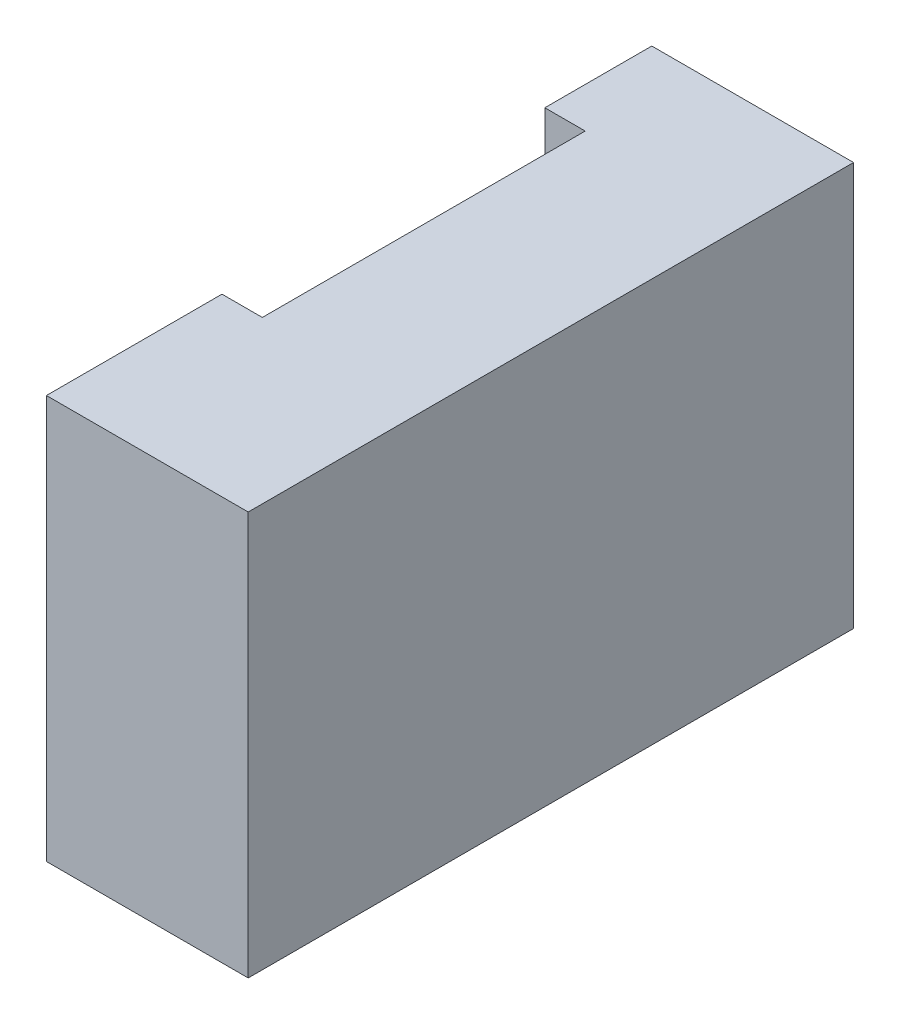
ISO-10303-21;
HEADER;
FILE_DESCRIPTION(('STEP AP214'),'2;1');
FILE_NAME('part.step','',(''),(''),'','','');
FILE_SCHEMA(('AUTOMOTIVE_DESIGN { 1 0 10303 214 1 1 1 1 }'));
ENDSEC;
DATA;
#1=APPLICATION_CONTEXT('core data for automotive mechanical design processes');
#2=APPLICATION_PROTOCOL_DEFINITION('international standard','automotive_design',2000,#1);
#3=PRODUCT_CONTEXT('',#1,'mechanical');
#4=PRODUCT('Part','Part','',(#3));
#5=PRODUCT_RELATED_PRODUCT_CATEGORY('part','',(#4));
#6=PRODUCT_DEFINITION_FORMATION('','',#4);
#7=PRODUCT_DEFINITION_CONTEXT('part definition',#1,'design');
#8=PRODUCT_DEFINITION('design','',#6,#7);
#9=PRODUCT_DEFINITION_SHAPE('','',#8);
#10=(LENGTH_UNIT() NAMED_UNIT(*) SI_UNIT(.MILLI.,.METRE.));
#11=(NAMED_UNIT(*) PLANE_ANGLE_UNIT() SI_UNIT($,.RADIAN.));
#12=(NAMED_UNIT(*) SI_UNIT($,.STERADIAN.) SOLID_ANGLE_UNIT());
#13=UNCERTAINTY_MEASURE_WITH_UNIT(LENGTH_MEASURE(1.E-05),#10,'distance_accuracy_value','');
#14=(GEOMETRIC_REPRESENTATION_CONTEXT(3) GLOBAL_UNCERTAINTY_ASSIGNED_CONTEXT((#13)) GLOBAL_UNIT_ASSIGNED_CONTEXT((#10,
#11,#12)) REPRESENTATION_CONTEXT('',''));
#15=CARTESIAN_POINT('',(0.,0.,0.));
#16=DIRECTION('',(0.,0.,1.));
#17=DIRECTION('',(1.,0.,0.));
#18=AXIS2_PLACEMENT_3D('',#15,#16,#17);
#19=CARTESIAN_POINT('',(-2.5,-5.,7.5));
#20=DIRECTION('',(1.,0.,0.));
#21=DIRECTION('',(0.,0.,-1.));
#22=AXIS2_PLACEMENT_3D('',#19,#20,#21);
#23=PLANE('',#22);
#24=DIRECTION('',(0.,0.,-1.));
#25=VECTOR('',#24,1.);
#26=CARTESIAN_POINT('',(-2.5,-5.,7.5));
#27=LINE('',#26,#25);
#28=CARTESIAN_POINT('',(-2.5,-5.,-4.85));
#29=VERTEX_POINT('',#28);
#30=CARTESIAN_POINT('',(-2.5,-5.,-7.5));
#31=VERTEX_POINT('',#30);
#32=EDGE_CURVE('E125',#29,#31,#27,.T.);
#33=ORIENTED_EDGE('',*,*,#32,.F.);
#34=DIRECTION('',(0.,1.,0.));
#35=VECTOR('',#34,1.);
#36=CARTESIAN_POINT('',(-2.5,-5.,-4.85));
#37=LINE('',#36,#35);
#38=CARTESIAN_POINT('',(-2.5,5.,-4.85));
#39=VERTEX_POINT('',#38);
#40=EDGE_CURVE('E141',#29,#39,#37,.T.);
#41=ORIENTED_EDGE('',*,*,#40,.T.);
#42=DIRECTION('',(0.,0.,-1.));
#43=VECTOR('',#42,1.);
#44=CARTESIAN_POINT('',(-2.5,5.,7.5));
#45=LINE('',#44,#43);
#46=CARTESIAN_POINT('',(-2.5,5.,-7.5));
#47=VERTEX_POINT('',#46);
#48=EDGE_CURVE('E124',#39,#47,#45,.T.);
#49=ORIENTED_EDGE('',*,*,#48,.T.);
#50=DIRECTION('',(0.,-1.,0.));
#51=VECTOR('',#50,1.);
#52=CARTESIAN_POINT('',(-2.5,-5.,-7.5));
#53=LINE('',#52,#51);
#54=EDGE_CURVE('E132',#47,#31,#53,.T.);
#55=ORIENTED_EDGE('',*,*,#54,.T.);
#56=EDGE_LOOP('',(#33,#41,#49,#55));
#57=FACE_BOUND('',#56,.T.);
#58=ADVANCED_FACE('F33',(#57),#23,.F.);
#59=CARTESIAN_POINT('',(2.5,-5.,7.5));
#60=DIRECTION('',(-1.,0.,0.));
#61=DIRECTION('',(0.,0.,1.));
#62=AXIS2_PLACEMENT_3D('',#59,#60,#61);
#63=PLANE('',#62);
#64=DIRECTION('',(0.,1.,0.));
#65=VECTOR('',#64,1.);
#66=CARTESIAN_POINT('',(2.5,-5.,-7.5));
#67=LINE('',#66,#65);
#68=CARTESIAN_POINT('',(2.5,-5.,-7.5));
#69=VERTEX_POINT('',#68);
#70=CARTESIAN_POINT('',(2.5,5.,-7.5));
#71=VERTEX_POINT('',#70);
#72=EDGE_CURVE('E138',#69,#71,#67,.T.);
#73=ORIENTED_EDGE('',*,*,#72,.T.);
#74=DIRECTION('',(0.,0.,-1.));
#75=VECTOR('',#74,1.);
#76=CARTESIAN_POINT('',(2.5,5.,7.5));
#77=LINE('',#76,#75);
#78=CARTESIAN_POINT('',(2.5,5.,7.5));
#79=VERTEX_POINT('',#78);
#80=EDGE_CURVE('E11',#79,#71,#77,.T.);
#81=ORIENTED_EDGE('',*,*,#80,.F.);
#82=DIRECTION('',(0.,1.,0.));
#83=VECTOR('',#82,1.);
#84=CARTESIAN_POINT('',(2.5,-5.,7.5));
#85=LINE('',#84,#83);
#86=CARTESIAN_POINT('',(2.5,-5.,7.5));
#87=VERTEX_POINT('',#86);
#88=EDGE_CURVE('E131',#87,#79,#85,.T.);
#89=ORIENTED_EDGE('',*,*,#88,.F.);
#90=DIRECTION('',(0.,0.,-1.));
#91=VECTOR('',#90,1.);
#92=CARTESIAN_POINT('',(2.5,-5.,7.5));
#93=LINE('',#92,#91);
#94=EDGE_CURVE('E127',#87,#69,#93,.T.);
#95=ORIENTED_EDGE('',*,*,#94,.T.);
#96=EDGE_LOOP('',(#73,#81,#89,#95));
#97=FACE_BOUND('',#96,.T.);
#98=ADVANCED_FACE('F35',(#97),#63,.F.);
#99=CARTESIAN_POINT('',(-2.5,5.,7.5));
#100=DIRECTION('',(0.,-1.,0.));
#101=DIRECTION('',(0.,0.,-1.));
#102=AXIS2_PLACEMENT_3D('',#99,#100,#101);
#103=PLANE('',#102);
#104=ORIENTED_EDGE('',*,*,#48,.F.);
#105=DIRECTION('',(-1.,0.,0.));
#106=VECTOR('',#105,1.);
#107=CARTESIAN_POINT('',(-2.5,5.,-4.85));
#108=LINE('',#107,#106);
#109=CARTESIAN_POINT('',(-1.5,5.,-4.85));
#110=VERTEX_POINT('',#109);
#111=EDGE_CURVE('E113',#110,#39,#108,.T.);
#112=ORIENTED_EDGE('',*,*,#111,.F.);
#113=DIRECTION('',(0.,0.,-1.));
#114=VECTOR('',#113,1.);
#115=CARTESIAN_POINT('',(-1.5,5.,-4.85));
#116=LINE('',#115,#114);
#117=CARTESIAN_POINT('',(-1.5,5.,3.15));
#118=VERTEX_POINT('',#117);
#119=EDGE_CURVE('E153',#118,#110,#116,.T.);
#120=ORIENTED_EDGE('',*,*,#119,.F.);
#121=DIRECTION('',(1.,0.,0.));
#122=VECTOR('',#121,1.);
#123=CARTESIAN_POINT('',(-2.5,5.,3.15));
#124=LINE('',#123,#122);
#125=CARTESIAN_POINT('',(-2.5,5.,3.15));
#126=VERTEX_POINT('',#125);
#127=EDGE_CURVE('E156',#126,#118,#124,.T.);
#128=ORIENTED_EDGE('',*,*,#127,.F.);
#129=CARTESIAN_POINT('',(-2.5,5.,7.5));
#130=VERTEX_POINT('',#129);
#131=EDGE_CURVE('E41',#130,#126,#45,.T.);
#132=ORIENTED_EDGE('',*,*,#131,.F.);
#133=DIRECTION('',(-1.,0.,0.));
#134=VECTOR('',#133,1.);
#135=CARTESIAN_POINT('',(-2.5,5.,7.5));
#136=LINE('',#135,#134);
#137=EDGE_CURVE('E84',#79,#130,#136,.T.);
#138=ORIENTED_EDGE('',*,*,#137,.F.);
#139=ORIENTED_EDGE('',*,*,#80,.T.);
#140=DIRECTION('',(-1.,0.,0.));
#141=VECTOR('',#140,1.);
#142=CARTESIAN_POINT('',(-2.5,5.,-7.5));
#143=LINE('',#142,#141);
#144=EDGE_CURVE('E135',#71,#47,#143,.T.);
#145=ORIENTED_EDGE('',*,*,#144,.T.);
#146=EDGE_LOOP('',(#104,#112,#120,#128,#132,#138,#139,#145));
#147=FACE_BOUND('',#146,.T.);
#148=ADVANCED_FACE('F173',(#147),#103,.F.);
#149=ORIENTED_EDGE('',*,*,#131,.T.);
#150=DIRECTION('',(0.,1.,0.));
#151=VECTOR('',#150,1.);
#152=CARTESIAN_POINT('',(-2.5,-5.,3.15));
#153=LINE('',#152,#151);
#154=CARTESIAN_POINT('',(-2.5,-5.,3.15));
#155=VERTEX_POINT('',#154);
#156=EDGE_CURVE('E109',#155,#126,#153,.T.);
#157=ORIENTED_EDGE('',*,*,#156,.F.);
#158=CARTESIAN_POINT('',(-2.5,-5.,7.5));
#159=VERTEX_POINT('',#158);
#160=EDGE_CURVE('E120',#159,#155,#27,.T.);
#161=ORIENTED_EDGE('',*,*,#160,.F.);
#162=DIRECTION('',(0.,-1.,0.));
#163=VECTOR('',#162,1.);
#164=CARTESIAN_POINT('',(-2.5,-5.,7.5));
#165=LINE('',#164,#163);
#166=EDGE_CURVE('E143',#130,#159,#165,.T.);
#167=ORIENTED_EDGE('',*,*,#166,.F.);
#168=EDGE_LOOP('',(#149,#157,#161,#167));
#169=FACE_BOUND('',#168,.T.);
#170=ADVANCED_FACE('F118',(#169),#23,.F.);
#171=CARTESIAN_POINT('',(-2.5,-5.,7.5));
#172=DIRECTION('',(0.,1.,0.));
#173=DIRECTION('',(0.,0.,1.));
#174=AXIS2_PLACEMENT_3D('',#171,#172,#173);
#175=PLANE('',#174);
#176=DIRECTION('',(0.,0.,-1.));
#177=VECTOR('',#176,1.);
#178=CARTESIAN_POINT('',(-1.5,-5.,-4.85));
#179=LINE('',#178,#177);
#180=CARTESIAN_POINT('',(-1.5,-5.,3.15));
#181=VERTEX_POINT('',#180);
#182=CARTESIAN_POINT('',(-1.5,-5.,-4.85));
#183=VERTEX_POINT('',#182);
#184=EDGE_CURVE('E48',#181,#183,#179,.T.);
#185=ORIENTED_EDGE('',*,*,#184,.T.);
#186=DIRECTION('',(-1.,0.,0.));
#187=VECTOR('',#186,1.);
#188=CARTESIAN_POINT('',(-2.5,-5.,-4.85));
#189=LINE('',#188,#187);
#190=EDGE_CURVE('E121',#183,#29,#189,.T.);
#191=ORIENTED_EDGE('',*,*,#190,.T.);
#192=ORIENTED_EDGE('',*,*,#32,.T.);
#193=DIRECTION('',(1.,0.,0.));
#194=VECTOR('',#193,1.);
#195=CARTESIAN_POINT('',(-2.5,-5.,-7.5));
#196=LINE('',#195,#194);
#197=EDGE_CURVE('E77',#31,#69,#196,.T.);
#198=ORIENTED_EDGE('',*,*,#197,.T.);
#199=ORIENTED_EDGE('',*,*,#94,.F.);
#200=DIRECTION('',(1.,0.,0.));
#201=VECTOR('',#200,1.);
#202=CARTESIAN_POINT('',(-2.5,-5.,7.5));
#203=LINE('',#202,#201);
#204=EDGE_CURVE('E57',#159,#87,#203,.T.);
#205=ORIENTED_EDGE('',*,*,#204,.F.);
#206=ORIENTED_EDGE('',*,*,#160,.T.);
#207=DIRECTION('',(1.,0.,0.));
#208=VECTOR('',#207,1.);
#209=CARTESIAN_POINT('',(-2.5,-5.,3.15));
#210=LINE('',#209,#208);
#211=EDGE_CURVE('E105',#155,#181,#210,.T.);
#212=ORIENTED_EDGE('',*,*,#211,.T.);
#213=EDGE_LOOP('',(#185,#191,#192,#198,#199,#205,#206,#212));
#214=FACE_BOUND('',#213,.T.);
#215=ADVANCED_FACE('F123',(#214),#175,.F.);
#216=CARTESIAN_POINT('',(0.,0.,7.5));
#217=DIRECTION('',(0.,0.,-1.));
#218=DIRECTION('',(-1.,0.,0.));
#219=AXIS2_PLACEMENT_3D('',#216,#217,#218);
#220=PLANE('',#219);
#221=ORIENTED_EDGE('',*,*,#88,.T.);
#222=ORIENTED_EDGE('',*,*,#137,.T.);
#223=ORIENTED_EDGE('',*,*,#166,.T.);
#224=ORIENTED_EDGE('',*,*,#204,.T.);
#225=EDGE_LOOP('',(#221,#222,#223,#224));
#226=FACE_BOUND('',#225,.T.);
#227=ADVANCED_FACE('F172',(#226),#220,.F.);
#228=CARTESIAN_POINT('',(0.,0.,-7.5));
#229=DIRECTION('',(0.,0.,-1.));
#230=DIRECTION('',(-1.,0.,0.));
#231=AXIS2_PLACEMENT_3D('',#228,#229,#230);
#232=PLANE('',#231);
#233=ORIENTED_EDGE('',*,*,#72,.F.);
#234=ORIENTED_EDGE('',*,*,#197,.F.);
#235=ORIENTED_EDGE('',*,*,#54,.F.);
#236=ORIENTED_EDGE('',*,*,#144,.F.);
#237=EDGE_LOOP('',(#233,#234,#235,#236));
#238=FACE_BOUND('',#237,.T.);
#239=ADVANCED_FACE('F168',(#238),#232,.T.);
#240=CARTESIAN_POINT('',(-2.5,-5.,-4.85));
#241=DIRECTION('',(0.,0.,-1.));
#242=DIRECTION('',(-1.,0.,0.));
#243=AXIS2_PLACEMENT_3D('',#240,#241,#242);
#244=PLANE('',#243);
#245=ORIENTED_EDGE('',*,*,#111,.T.);
#246=ORIENTED_EDGE('',*,*,#40,.F.);
#247=ORIENTED_EDGE('',*,*,#190,.F.);
#248=DIRECTION('',(0.,1.,0.));
#249=VECTOR('',#248,1.);
#250=CARTESIAN_POINT('',(-1.5,-5.,-4.85));
#251=LINE('',#250,#249);
#252=EDGE_CURVE('E148',#183,#110,#251,.T.);
#253=ORIENTED_EDGE('',*,*,#252,.T.);
#254=EDGE_LOOP('',(#245,#246,#247,#253));
#255=FACE_BOUND('',#254,.T.);
#256=ADVANCED_FACE('F177',(#255),#244,.F.);
#257=CARTESIAN_POINT('',(-1.5,-5.,-4.85));
#258=DIRECTION('',(1.,0.,0.));
#259=DIRECTION('',(0.,0.,-1.));
#260=AXIS2_PLACEMENT_3D('',#257,#258,#259);
#261=PLANE('',#260);
#262=ORIENTED_EDGE('',*,*,#119,.T.);
#263=ORIENTED_EDGE('',*,*,#252,.F.);
#264=ORIENTED_EDGE('',*,*,#184,.F.);
#265=DIRECTION('',(0.,1.,0.));
#266=VECTOR('',#265,1.);
#267=CARTESIAN_POINT('',(-1.5,-5.,3.15));
#268=LINE('',#267,#266);
#269=EDGE_CURVE('E111',#181,#118,#268,.T.);
#270=ORIENTED_EDGE('',*,*,#269,.T.);
#271=EDGE_LOOP('',(#262,#263,#264,#270));
#272=FACE_BOUND('',#271,.T.);
#273=ADVANCED_FACE('F176',(#272),#261,.F.);
#274=CARTESIAN_POINT('',(-2.5,-5.,3.15));
#275=DIRECTION('',(0.,0.,1.));
#276=DIRECTION('',(1.,0.,0.));
#277=AXIS2_PLACEMENT_3D('',#274,#275,#276);
#278=PLANE('',#277);
#279=ORIENTED_EDGE('',*,*,#127,.T.);
#280=ORIENTED_EDGE('',*,*,#269,.F.);
#281=ORIENTED_EDGE('',*,*,#211,.F.);
#282=ORIENTED_EDGE('',*,*,#156,.T.);
#283=EDGE_LOOP('',(#279,#280,#281,#282));
#284=FACE_BOUND('',#283,.T.);
#285=ADVANCED_FACE('F108',(#284),#278,.F.);
#286=CLOSED_SHELL('',(#58,#98,#148,#170,#215,#227,#239,#256,#273,#285));
#287=MANIFOLD_SOLID_BREP('B2',#286);
#288=ADVANCED_BREP_SHAPE_REPRESENTATION('',(#18,#287),#14);
#289=SHAPE_DEFINITION_REPRESENTATION(#9,#288);
ENDSEC;
END-ISO-10303-21;
